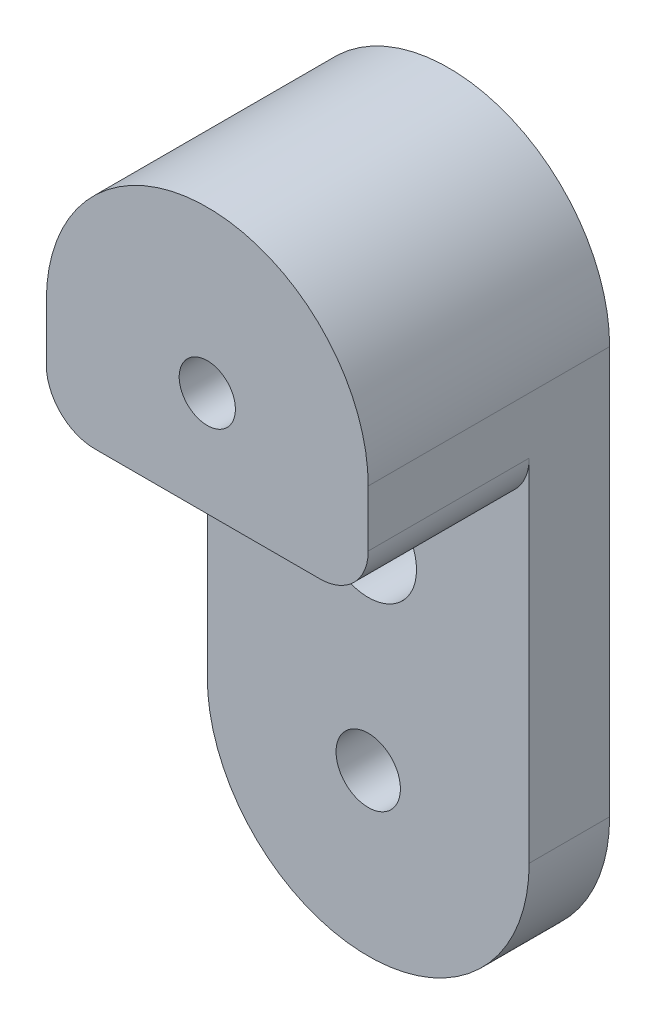
ISO-10303-21;
HEADER;
FILE_DESCRIPTION(('STEP AP214'),'2;1');
FILE_NAME('part.step','',(''),(''),'','','');
FILE_SCHEMA(('AUTOMOTIVE_DESIGN { 1 0 10303 214 1 1 1 1 }'));
ENDSEC;
DATA;
#1=APPLICATION_CONTEXT('core data for automotive mechanical design processes');
#2=APPLICATION_PROTOCOL_DEFINITION('international standard','automotive_design',2000,#1);
#3=PRODUCT_CONTEXT('',#1,'mechanical');
#4=PRODUCT('Part','Part','',(#3));
#5=PRODUCT_RELATED_PRODUCT_CATEGORY('part','',(#4));
#6=PRODUCT_DEFINITION_FORMATION('','',#4);
#7=PRODUCT_DEFINITION_CONTEXT('part definition',#1,'design');
#8=PRODUCT_DEFINITION('design','',#6,#7);
#9=PRODUCT_DEFINITION_SHAPE('','',#8);
#10=(LENGTH_UNIT() NAMED_UNIT(*) SI_UNIT(.MILLI.,.METRE.));
#11=(NAMED_UNIT(*) PLANE_ANGLE_UNIT() SI_UNIT($,.RADIAN.));
#12=(NAMED_UNIT(*) SI_UNIT($,.STERADIAN.) SOLID_ANGLE_UNIT());
#13=UNCERTAINTY_MEASURE_WITH_UNIT(LENGTH_MEASURE(1.E-05),#10,'distance_accuracy_value','');
#14=(GEOMETRIC_REPRESENTATION_CONTEXT(3) GLOBAL_UNCERTAINTY_ASSIGNED_CONTEXT((#13)) GLOBAL_UNIT_ASSIGNED_CONTEXT((#10,
#11,#12)) REPRESENTATION_CONTEXT('',''));
#15=CARTESIAN_POINT('',(0.,0.,0.));
#16=DIRECTION('',(0.,0.,1.));
#17=DIRECTION('',(1.,0.,0.));
#18=AXIS2_PLACEMENT_3D('',#15,#16,#17);
#19=CARTESIAN_POINT('',(-10.,0.,5.));
#20=DIRECTION('',(1.,0.,0.));
#21=DIRECTION('',(0.,1.,0.));
#22=AXIS2_PLACEMENT_3D('',#19,#20,#21);
#23=PLANE('',#22);
#24=DIRECTION('',(0.,-1.,0.));
#25=VECTOR('',#24,1.);
#26=CARTESIAN_POINT('',(-10.,0.,5.));
#27=LINE('',#26,#25);
#28=CARTESIAN_POINT('',(-10.,-3.5,5.));
#29=VERTEX_POINT('',#28);
#30=CARTESIAN_POINT('',(-10.,-25.3,5.));
#31=VERTEX_POINT('',#30);
#32=EDGE_CURVE('E49',#29,#31,#27,.T.);
#33=ORIENTED_EDGE('',*,*,#32,.F.);
#34=DIRECTION('',(0.,0.,-1.));
#35=VECTOR('',#34,1.);
#36=CARTESIAN_POINT('',(-10.,-3.5,5.));
#37=LINE('',#36,#35);
#38=CARTESIAN_POINT('',(-10.,-3.5,15.));
#39=VERTEX_POINT('',#38);
#40=EDGE_CURVE('E53',#29,#39,#37,.F.);
#41=ORIENTED_EDGE('',*,*,#40,.T.);
#42=DIRECTION('',(0.,-1.,0.));
#43=VECTOR('',#42,1.);
#44=CARTESIAN_POINT('',(-10.,0.,15.));
#45=LINE('',#44,#43);
#46=CARTESIAN_POINT('',(-10.,0.,15.));
#47=VERTEX_POINT('',#46);
#48=EDGE_CURVE('E128',#47,#39,#45,.T.);
#49=ORIENTED_EDGE('',*,*,#48,.F.);
#50=DIRECTION('',(0.,0.,-1.));
#51=VECTOR('',#50,1.);
#52=CARTESIAN_POINT('',(-10.,0.,15.));
#53=LINE('',#52,#51);
#54=CARTESIAN_POINT('',(-10.,0.,0.));
#55=VERTEX_POINT('',#54);
#56=EDGE_CURVE('E112',#47,#55,#53,.T.);
#57=ORIENTED_EDGE('',*,*,#56,.T.);
#58=DIRECTION('',(0.,-1.,0.));
#59=VECTOR('',#58,1.);
#60=CARTESIAN_POINT('',(-10.,0.,0.));
#61=LINE('',#60,#59);
#62=CARTESIAN_POINT('',(-10.,-25.3,0.));
#63=VERTEX_POINT('',#62);
#64=EDGE_CURVE('E161',#55,#63,#61,.T.);
#65=ORIENTED_EDGE('',*,*,#64,.T.);
#66=DIRECTION('',(0.,0.,-1.));
#67=VECTOR('',#66,1.);
#68=CARTESIAN_POINT('',(-10.,-25.3,5.));
#69=LINE('',#68,#67);
#70=EDGE_CURVE('E169',#31,#63,#69,.T.);
#71=ORIENTED_EDGE('',*,*,#70,.F.);
#72=EDGE_LOOP('',(#33,#41,#49,#57,#65,#71));
#73=FACE_BOUND('',#72,.T.);
#74=ADVANCED_FACE('F34',(#73),#23,.F.);
#75=CARTESIAN_POINT('',(0.,-25.3,5.));
#76=DIRECTION('',(0.,0.,-1.));
#77=DIRECTION('',(-1.,0.,0.));
#78=AXIS2_PLACEMENT_3D('',#75,#76,#77);
#79=CYLINDRICAL_SURFACE('',#78,10.);
#80=CARTESIAN_POINT('',(0.,-25.3,0.));
#81=DIRECTION('',(0.,0.,1.));
#82=DIRECTION('',(1.,0.,0.));
#83=AXIS2_PLACEMENT_3D('',#80,#81,#82);
#84=CIRCLE('',#83,10.);
#85=CARTESIAN_POINT('',(10.,-25.3,0.));
#86=VERTEX_POINT('',#85);
#87=EDGE_CURVE('E164',#63,#86,#84,.T.);
#88=ORIENTED_EDGE('',*,*,#87,.T.);
#89=DIRECTION('',(0.,0.,-1.));
#90=VECTOR('',#89,1.);
#91=CARTESIAN_POINT('',(10.,-25.3,5.));
#92=LINE('',#91,#90);
#93=CARTESIAN_POINT('',(10.,-25.3,5.));
#94=VERTEX_POINT('',#93);
#95=EDGE_CURVE('E155',#94,#86,#92,.T.);
#96=ORIENTED_EDGE('',*,*,#95,.F.);
#97=CARTESIAN_POINT('',(0.,-25.3,5.));
#98=DIRECTION('',(0.,0.,1.));
#99=DIRECTION('',(1.,0.,0.));
#100=AXIS2_PLACEMENT_3D('',#97,#98,#99);
#101=CIRCLE('',#100,10.);
#102=EDGE_CURVE('E147',#31,#94,#101,.T.);
#103=ORIENTED_EDGE('',*,*,#102,.F.);
#104=ORIENTED_EDGE('',*,*,#70,.T.);
#105=EDGE_LOOP('',(#88,#96,#103,#104));
#106=FACE_BOUND('',#105,.T.);
#107=ADVANCED_FACE('F195',(#106),#79,.T.);
#108=CARTESIAN_POINT('',(10.,0.,5.));
#109=DIRECTION('',(1.,0.,0.));
#110=DIRECTION('',(0.,1.,0.));
#111=AXIS2_PLACEMENT_3D('',#108,#109,#110);
#112=PLANE('',#111);
#113=DIRECTION('',(0.,-1.,0.));
#114=VECTOR('',#113,1.);
#115=CARTESIAN_POINT('',(10.,0.,15.));
#116=LINE('',#115,#114);
#117=CARTESIAN_POINT('',(10.,0.,15.));
#118=VERTEX_POINT('',#117);
#119=CARTESIAN_POINT('',(10.,-3.5,15.));
#120=VERTEX_POINT('',#119);
#121=EDGE_CURVE('E104',#118,#120,#116,.T.);
#122=ORIENTED_EDGE('',*,*,#121,.T.);
#123=DIRECTION('',(0.,0.,-1.));
#124=VECTOR('',#123,1.);
#125=CARTESIAN_POINT('',(10.,-3.5,5.));
#126=LINE('',#125,#124);
#127=CARTESIAN_POINT('',(10.,-3.5,5.));
#128=VERTEX_POINT('',#127);
#129=EDGE_CURVE('E172',#120,#128,#126,.T.);
#130=ORIENTED_EDGE('',*,*,#129,.T.);
#131=DIRECTION('',(0.,-1.,0.));
#132=VECTOR('',#131,1.);
#133=CARTESIAN_POINT('',(10.,0.,5.));
#134=LINE('',#133,#132);
#135=EDGE_CURVE('E149',#128,#94,#134,.T.);
#136=ORIENTED_EDGE('',*,*,#135,.T.);
#137=ORIENTED_EDGE('',*,*,#95,.T.);
#138=DIRECTION('',(0.,-1.,0.));
#139=VECTOR('',#138,1.);
#140=CARTESIAN_POINT('',(10.,0.,0.));
#141=LINE('',#140,#139);
#142=CARTESIAN_POINT('',(10.,0.,0.));
#143=VERTEX_POINT('',#142);
#144=EDGE_CURVE('E107',#143,#86,#141,.T.);
#145=ORIENTED_EDGE('',*,*,#144,.F.);
#146=DIRECTION('',(0.,0.,-1.));
#147=VECTOR('',#146,1.);
#148=CARTESIAN_POINT('',(10.,0.,15.));
#149=LINE('',#148,#147);
#150=EDGE_CURVE('E99',#118,#143,#149,.T.);
#151=ORIENTED_EDGE('',*,*,#150,.F.);
#152=EDGE_LOOP('',(#122,#130,#136,#137,#145,#151));
#153=FACE_BOUND('',#152,.T.);
#154=ADVANCED_FACE('F101',(#153),#112,.T.);
#155=CARTESIAN_POINT('',(0.,-25.3,5.));
#156=DIRECTION('',(0.,0.,-1.));
#157=DIRECTION('',(-1.,0.,0.));
#158=AXIS2_PLACEMENT_3D('',#155,#156,#157);
#159=CYLINDRICAL_SURFACE('',#158,2.);
#160=CARTESIAN_POINT('',(0.,-25.3,5.));
#161=DIRECTION('',(0.,0.,1.));
#162=DIRECTION('',(1.,0.,0.));
#163=AXIS2_PLACEMENT_3D('',#160,#161,#162);
#164=CIRCLE('',#163,2.);
#165=CARTESIAN_POINT('',(2.,-25.3,5.));
#166=VERTEX_POINT('',#165);
#167=EDGE_CURVE('E143',#166,#166,#164,.T.);
#168=ORIENTED_EDGE('',*,*,#167,.T.);
#169=EDGE_LOOP('',(#168));
#170=FACE_BOUND('',#169,.T.);
#171=CARTESIAN_POINT('',(0.,-25.3,0.));
#172=DIRECTION('',(0.,0.,1.));
#173=DIRECTION('',(1.,0.,0.));
#174=AXIS2_PLACEMENT_3D('',#171,#172,#173);
#175=CIRCLE('',#174,2.);
#176=CARTESIAN_POINT('',(2.,-25.3,0.));
#177=VERTEX_POINT('',#176);
#178=EDGE_CURVE('E158',#177,#177,#175,.T.);
#179=ORIENTED_EDGE('',*,*,#178,.F.);
#180=EDGE_LOOP('',(#179));
#181=FACE_BOUND('',#180,.T.);
#182=ADVANCED_FACE('F213',(#170,#181),#159,.F.);
#183=CARTESIAN_POINT('',(0.,-13.,5.));
#184=DIRECTION('',(0.,0.,-1.));
#185=DIRECTION('',(-1.,0.,0.));
#186=AXIS2_PLACEMENT_3D('',#183,#184,#185);
#187=CYLINDRICAL_SURFACE('',#186,3.);
#188=CARTESIAN_POINT('',(0.,-13.,5.));
#189=DIRECTION('',(0.,0.,1.));
#190=DIRECTION('',(1.,0.,0.));
#191=AXIS2_PLACEMENT_3D('',#188,#189,#190);
#192=CIRCLE('',#191,3.);
#193=CARTESIAN_POINT('',(3.,-13.,5.));
#194=VERTEX_POINT('',#193);
#195=EDGE_CURVE('E140',#194,#194,#192,.T.);
#196=ORIENTED_EDGE('',*,*,#195,.T.);
#197=EDGE_LOOP('',(#196));
#198=FACE_BOUND('',#197,.T.);
#199=CARTESIAN_POINT('',(0.,-13.,0.));
#200=DIRECTION('',(0.,0.,1.));
#201=DIRECTION('',(1.,0.,0.));
#202=AXIS2_PLACEMENT_3D('',#199,#200,#201);
#203=CIRCLE('',#202,3.);
#204=CARTESIAN_POINT('',(3.,-13.,0.));
#205=VERTEX_POINT('',#204);
#206=EDGE_CURVE('E111',#205,#205,#203,.T.);
#207=ORIENTED_EDGE('',*,*,#206,.F.);
#208=EDGE_LOOP('',(#207));
#209=FACE_BOUND('',#208,.T.);
#210=ADVANCED_FACE('F216',(#198,#209),#187,.F.);
#211=CARTESIAN_POINT('',(0.,0.,5.));
#212=DIRECTION('',(0.,0.,1.));
#213=DIRECTION('',(1.,0.,0.));
#214=AXIS2_PLACEMENT_3D('',#211,#212,#213);
#215=PLANE('',#214);
#216=ORIENTED_EDGE('',*,*,#195,.F.);
#217=EDGE_LOOP('',(#216));
#218=FACE_BOUND('',#217,.T.);
#219=ORIENTED_EDGE('',*,*,#167,.F.);
#220=EDGE_LOOP('',(#219));
#221=FACE_BOUND('',#220,.T.);
#222=ORIENTED_EDGE('',*,*,#32,.T.);
#223=ORIENTED_EDGE('',*,*,#102,.T.);
#224=ORIENTED_EDGE('',*,*,#135,.F.);
#225=CARTESIAN_POINT('',(7.,-3.5,5.));
#226=DIRECTION('',(0.,0.,1.));
#227=DIRECTION('',(1.,0.,0.));
#228=AXIS2_PLACEMENT_3D('',#225,#226,#227);
#229=CIRCLE('',#228,3.);
#230=CARTESIAN_POINT('',(7.,-6.5,5.));
#231=VERTEX_POINT('',#230);
#232=EDGE_CURVE('E42',#128,#231,#229,.F.);
#233=ORIENTED_EDGE('',*,*,#232,.T.);
#234=DIRECTION('',(1.,0.,0.));
#235=VECTOR('',#234,1.);
#236=CARTESIAN_POINT('',(0.,-6.5,5.));
#237=LINE('',#236,#235);
#238=CARTESIAN_POINT('',(-7.,-6.5,5.));
#239=VERTEX_POINT('',#238);
#240=EDGE_CURVE('E152',#239,#231,#237,.T.);
#241=ORIENTED_EDGE('',*,*,#240,.F.);
#242=CARTESIAN_POINT('',(-7.,-3.5,5.));
#243=DIRECTION('',(0.,0.,1.));
#244=DIRECTION('',(1.,0.,0.));
#245=AXIS2_PLACEMENT_3D('',#242,#243,#244);
#246=CIRCLE('',#245,3.);
#247=EDGE_CURVE('E11',#239,#29,#246,.F.);
#248=ORIENTED_EDGE('',*,*,#247,.T.);
#249=EDGE_LOOP('',(#222,#223,#224,#233,#241,#248));
#250=FACE_BOUND('',#249,.T.);
#251=ADVANCED_FACE('F185',(#218,#221,#250),#215,.T.);
#252=CARTESIAN_POINT('',(0.,0.,0.));
#253=DIRECTION('',(0.,0.,1.));
#254=DIRECTION('',(1.,0.,0.));
#255=AXIS2_PLACEMENT_3D('',#252,#253,#254);
#256=PLANE('',#255);
#257=ORIENTED_EDGE('',*,*,#206,.T.);
#258=EDGE_LOOP('',(#257));
#259=FACE_BOUND('',#258,.T.);
#260=ORIENTED_EDGE('',*,*,#178,.T.);
#261=EDGE_LOOP('',(#260));
#262=FACE_BOUND('',#261,.T.);
#263=ORIENTED_EDGE('',*,*,#64,.F.);
#264=CARTESIAN_POINT('',(0.,0.,0.));
#265=DIRECTION('',(0.,0.,1.));
#266=DIRECTION('',(1.,0.,0.));
#267=AXIS2_PLACEMENT_3D('',#264,#265,#266);
#268=CIRCLE('',#267,10.);
#269=EDGE_CURVE('E134',#143,#55,#268,.T.);
#270=ORIENTED_EDGE('',*,*,#269,.F.);
#271=ORIENTED_EDGE('',*,*,#144,.T.);
#272=ORIENTED_EDGE('',*,*,#87,.F.);
#273=EDGE_LOOP('',(#263,#270,#271,#272));
#274=FACE_BOUND('',#273,.T.);
#275=CARTESIAN_POINT('',(0.,0.,0.));
#276=DIRECTION('',(0.,0.,1.));
#277=DIRECTION('',(1.,0.,0.));
#278=AXIS2_PLACEMENT_3D('',#275,#276,#277);
#279=CIRCLE('',#278,1.74625);
#280=CARTESIAN_POINT('',(1.74625,0.,0.));
#281=VERTEX_POINT('',#280);
#282=EDGE_CURVE('E136',#281,#281,#279,.T.);
#283=ORIENTED_EDGE('',*,*,#282,.T.);
#284=EDGE_LOOP('',(#283));
#285=FACE_BOUND('',#284,.T.);
#286=ADVANCED_FACE('F197',(#259,#262,#274,#285),#256,.F.);
#287=CARTESIAN_POINT('',(0.,-6.5,15.));
#288=DIRECTION('',(0.,1.,0.));
#289=DIRECTION('',(-1.,0.,0.));
#290=AXIS2_PLACEMENT_3D('',#287,#288,#289);
#291=PLANE('',#290);
#292=ORIENTED_EDGE('',*,*,#240,.T.);
#293=DIRECTION('',(0.,0.,-1.));
#294=VECTOR('',#293,1.);
#295=CARTESIAN_POINT('',(7.,-6.5,15.));
#296=LINE('',#295,#294);
#297=CARTESIAN_POINT('',(7.,-6.5,15.));
#298=VERTEX_POINT('',#297);
#299=EDGE_CURVE('E177',#231,#298,#296,.F.);
#300=ORIENTED_EDGE('',*,*,#299,.T.);
#301=DIRECTION('',(1.,0.,0.));
#302=VECTOR('',#301,1.);
#303=CARTESIAN_POINT('',(0.,-6.5,15.));
#304=LINE('',#303,#302);
#305=CARTESIAN_POINT('',(-7.,-6.5,15.));
#306=VERTEX_POINT('',#305);
#307=EDGE_CURVE('E126',#306,#298,#304,.T.);
#308=ORIENTED_EDGE('',*,*,#307,.F.);
#309=DIRECTION('',(0.,0.,-1.));
#310=VECTOR('',#309,1.);
#311=CARTESIAN_POINT('',(-7.,-6.5,15.));
#312=LINE('',#311,#310);
#313=EDGE_CURVE('E174',#306,#239,#312,.T.);
#314=ORIENTED_EDGE('',*,*,#313,.T.);
#315=EDGE_LOOP('',(#292,#300,#308,#314));
#316=FACE_BOUND('',#315,.T.);
#317=ADVANCED_FACE('F189',(#316),#291,.F.);
#318=CARTESIAN_POINT('',(0.,0.,15.));
#319=DIRECTION('',(0.,0.,-1.));
#320=DIRECTION('',(-1.,0.,0.));
#321=AXIS2_PLACEMENT_3D('',#318,#319,#320);
#322=CYLINDRICAL_SURFACE('',#321,10.);
#323=ORIENTED_EDGE('',*,*,#269,.T.);
#324=ORIENTED_EDGE('',*,*,#56,.F.);
#325=CARTESIAN_POINT('',(0.,0.,15.));
#326=DIRECTION('',(0.,0.,1.));
#327=DIRECTION('',(1.,0.,0.));
#328=AXIS2_PLACEMENT_3D('',#325,#326,#327);
#329=CIRCLE('',#328,10.);
#330=EDGE_CURVE('E115',#118,#47,#329,.T.);
#331=ORIENTED_EDGE('',*,*,#330,.F.);
#332=ORIENTED_EDGE('',*,*,#150,.T.);
#333=EDGE_LOOP('',(#323,#324,#331,#332));
#334=FACE_BOUND('',#333,.T.);
#335=ADVANCED_FACE('F116',(#334),#322,.T.);
#336=CARTESIAN_POINT('',(0.,0.,15.));
#337=DIRECTION('',(0.,0.,-1.));
#338=DIRECTION('',(-1.,0.,0.));
#339=AXIS2_PLACEMENT_3D('',#336,#337,#338);
#340=CYLINDRICAL_SURFACE('',#339,1.74625);
#341=CARTESIAN_POINT('',(0.,0.,15.));
#342=DIRECTION('',(0.,0.,1.));
#343=DIRECTION('',(1.,0.,0.));
#344=AXIS2_PLACEMENT_3D('',#341,#342,#343);
#345=CIRCLE('',#344,1.74625);
#346=CARTESIAN_POINT('',(1.74625,0.,15.));
#347=VERTEX_POINT('',#346);
#348=EDGE_CURVE('E119',#347,#347,#345,.T.);
#349=ORIENTED_EDGE('',*,*,#348,.T.);
#350=EDGE_LOOP('',(#349));
#351=FACE_BOUND('',#350,.T.);
#352=ORIENTED_EDGE('',*,*,#282,.F.);
#353=EDGE_LOOP('',(#352));
#354=FACE_BOUND('',#353,.T.);
#355=ADVANCED_FACE('F271',(#351,#354),#340,.F.);
#356=CARTESIAN_POINT('',(0.,0.,15.));
#357=DIRECTION('',(0.,0.,1.));
#358=DIRECTION('',(1.,0.,0.));
#359=AXIS2_PLACEMENT_3D('',#356,#357,#358);
#360=PLANE('',#359);
#361=ORIENTED_EDGE('',*,*,#307,.T.);
#362=CARTESIAN_POINT('',(7.,-3.5,15.));
#363=DIRECTION('',(0.,0.,1.));
#364=DIRECTION('',(1.,0.,0.));
#365=AXIS2_PLACEMENT_3D('',#362,#363,#364);
#366=CIRCLE('',#365,3.);
#367=EDGE_CURVE('E125',#298,#120,#366,.T.);
#368=ORIENTED_EDGE('',*,*,#367,.T.);
#369=ORIENTED_EDGE('',*,*,#121,.F.);
#370=ORIENTED_EDGE('',*,*,#330,.T.);
#371=ORIENTED_EDGE('',*,*,#48,.T.);
#372=CARTESIAN_POINT('',(-7.,-3.5,15.));
#373=DIRECTION('',(0.,0.,1.));
#374=DIRECTION('',(1.,0.,0.));
#375=AXIS2_PLACEMENT_3D('',#372,#373,#374);
#376=CIRCLE('',#375,3.);
#377=EDGE_CURVE('E179',#39,#306,#376,.T.);
#378=ORIENTED_EDGE('',*,*,#377,.T.);
#379=EDGE_LOOP('',(#361,#368,#369,#370,#371,#378));
#380=FACE_BOUND('',#379,.T.);
#381=ORIENTED_EDGE('',*,*,#348,.F.);
#382=EDGE_LOOP('',(#381));
#383=FACE_BOUND('',#382,.T.);
#384=ADVANCED_FACE('F122',(#380,#383),#360,.T.);
#385=CARTESIAN_POINT('',(7.,-3.5,5.));
#386=DIRECTION('',(0.,0.,1.));
#387=DIRECTION('',(1.,0.,0.));
#388=AXIS2_PLACEMENT_3D('',#385,#386,#387);
#389=CYLINDRICAL_SURFACE('',#388,3.);
#390=ORIENTED_EDGE('',*,*,#367,.F.);
#391=ORIENTED_EDGE('',*,*,#299,.F.);
#392=ORIENTED_EDGE('',*,*,#232,.F.);
#393=ORIENTED_EDGE('',*,*,#129,.F.);
#394=EDGE_LOOP('',(#390,#391,#392,#393));
#395=FACE_BOUND('',#394,.T.);
#396=ADVANCED_FACE('F192',(#395),#389,.T.);
#397=CARTESIAN_POINT('',(-7.,-3.5,15.));
#398=DIRECTION('',(0.,0.,-1.));
#399=DIRECTION('',(-1.,0.,0.));
#400=AXIS2_PLACEMENT_3D('',#397,#398,#399);
#401=CYLINDRICAL_SURFACE('',#400,3.);
#402=ORIENTED_EDGE('',*,*,#377,.F.);
#403=ORIENTED_EDGE('',*,*,#40,.F.);
#404=ORIENTED_EDGE('',*,*,#247,.F.);
#405=ORIENTED_EDGE('',*,*,#313,.F.);
#406=EDGE_LOOP('',(#402,#403,#404,#405));
#407=FACE_BOUND('',#406,.T.);
#408=ADVANCED_FACE('F36',(#407),#401,.T.);
#409=CLOSED_SHELL('',(#74,#107,#154,#182,#210,#251,#286,#317,#335,#355,#384,#396,#408));
#410=MANIFOLD_SOLID_BREP('B2',#409);
#411=ADVANCED_BREP_SHAPE_REPRESENTATION('',(#18,#410),#14);
#412=SHAPE_DEFINITION_REPRESENTATION(#9,#411);
ENDSEC;
END-ISO-10303-21;
